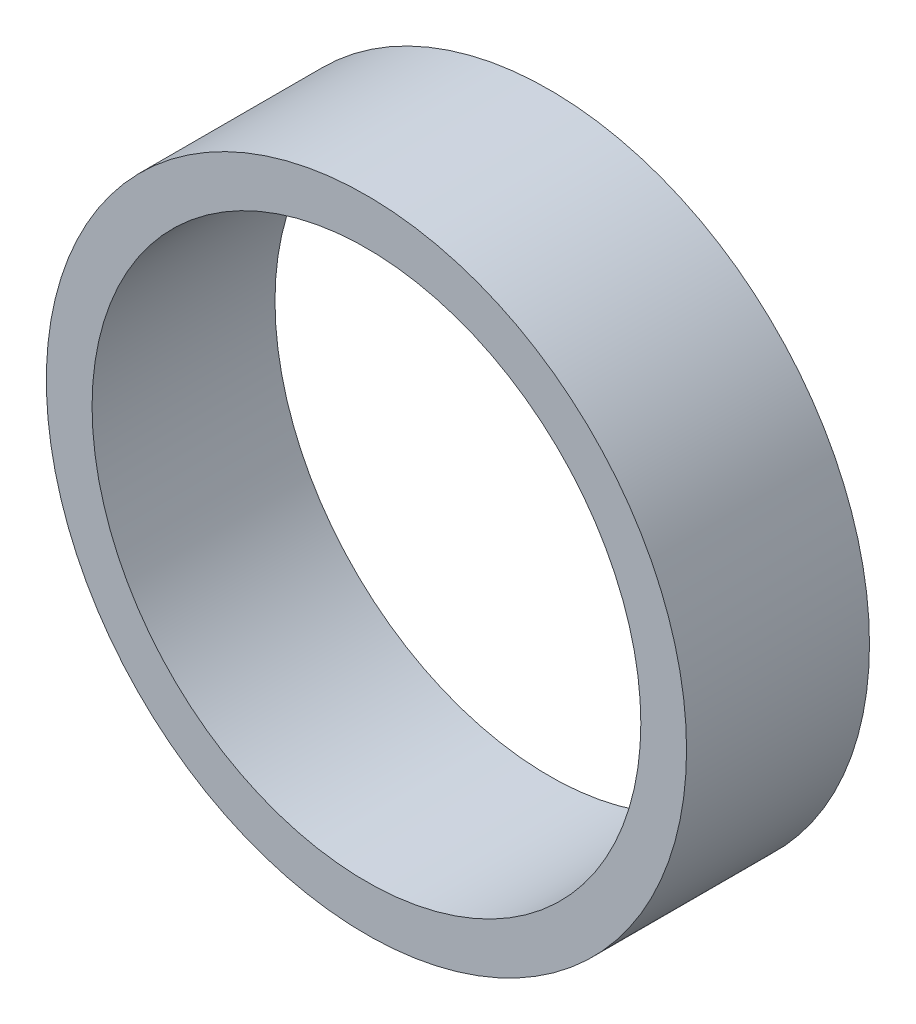
ISO-10303-21;
HEADER;
FILE_DESCRIPTION(('STEP AP214'),'2;1');
FILE_NAME('part.step','',(''),(''),'','','');
FILE_SCHEMA(('AUTOMOTIVE_DESIGN { 1 0 10303 214 1 1 1 1 }'));
ENDSEC;
DATA;
#1=APPLICATION_CONTEXT('core data for automotive mechanical design processes');
#2=APPLICATION_PROTOCOL_DEFINITION('international standard','automotive_design',2000,#1);
#3=PRODUCT_CONTEXT('',#1,'mechanical');
#4=PRODUCT('Part','Part','',(#3));
#5=PRODUCT_RELATED_PRODUCT_CATEGORY('part','',(#4));
#6=PRODUCT_DEFINITION_FORMATION('','',#4);
#7=PRODUCT_DEFINITION_CONTEXT('part definition',#1,'design');
#8=PRODUCT_DEFINITION('design','',#6,#7);
#9=PRODUCT_DEFINITION_SHAPE('','',#8);
#10=(LENGTH_UNIT() NAMED_UNIT(*) SI_UNIT(.MILLI.,.METRE.));
#11=(NAMED_UNIT(*) PLANE_ANGLE_UNIT() SI_UNIT($,.RADIAN.));
#12=(NAMED_UNIT(*) SI_UNIT($,.STERADIAN.) SOLID_ANGLE_UNIT());
#13=UNCERTAINTY_MEASURE_WITH_UNIT(LENGTH_MEASURE(1.E-05),#10,'distance_accuracy_value','');
#14=(GEOMETRIC_REPRESENTATION_CONTEXT(3) GLOBAL_UNCERTAINTY_ASSIGNED_CONTEXT((#13)) GLOBAL_UNIT_ASSIGNED_CONTEXT((#10,
#11,#12)) REPRESENTATION_CONTEXT('',''));
#15=CARTESIAN_POINT('',(0.,0.,0.));
#16=DIRECTION('',(0.,0.,1.));
#17=DIRECTION('',(1.,0.,0.));
#18=AXIS2_PLACEMENT_3D('',#15,#16,#17);
#19=CARTESIAN_POINT('',(0.,0.,2.));
#20=DIRECTION('',(0.,0.,1.));
#21=DIRECTION('',(1.,0.,0.));
#22=AXIS2_PLACEMENT_3D('',#19,#20,#21);
#23=PLANE('',#22);
#24=CARTESIAN_POINT('',(0.,0.,2.));
#25=DIRECTION('',(0.,0.,1.));
#26=DIRECTION('',(1.,0.,0.));
#27=AXIS2_PLACEMENT_3D('',#24,#25,#26);
#28=CIRCLE('',#27,3.5);
#29=CARTESIAN_POINT('',(3.5,0.,2.));
#30=VERTEX_POINT('',#29);
#31=EDGE_CURVE('E10',#30,#30,#28,.T.);
#32=ORIENTED_EDGE('',*,*,#31,.T.);
#33=EDGE_LOOP('',(#32));
#34=FACE_BOUND('',#33,.T.);
#35=CARTESIAN_POINT('',(0.,0.,2.));
#36=DIRECTION('',(0.,0.,1.));
#37=DIRECTION('',(1.,0.,0.));
#38=AXIS2_PLACEMENT_3D('',#35,#36,#37);
#39=CIRCLE('',#38,3.);
#40=CARTESIAN_POINT('',(3.,0.,2.));
#41=VERTEX_POINT('',#40);
#42=EDGE_CURVE('E56',#41,#41,#39,.T.);
#43=ORIENTED_EDGE('',*,*,#42,.F.);
#44=EDGE_LOOP('',(#43));
#45=FACE_BOUND('',#44,.T.);
#46=ADVANCED_FACE('F43',(#34,#45),#23,.T.);
#47=CARTESIAN_POINT('',(0.,0.,0.));
#48=DIRECTION('',(0.,0.,1.));
#49=DIRECTION('',(1.,0.,0.));
#50=AXIS2_PLACEMENT_3D('',#47,#48,#49);
#51=PLANE('',#50);
#52=CARTESIAN_POINT('',(0.,0.,0.));
#53=DIRECTION('',(0.,0.,1.));
#54=DIRECTION('',(1.,0.,0.));
#55=AXIS2_PLACEMENT_3D('',#52,#53,#54);
#56=CIRCLE('',#55,3.5);
#57=CARTESIAN_POINT('',(3.5,0.,0.));
#58=VERTEX_POINT('',#57);
#59=EDGE_CURVE('E47',#58,#58,#56,.T.);
#60=ORIENTED_EDGE('',*,*,#59,.F.);
#61=EDGE_LOOP('',(#60));
#62=FACE_BOUND('',#61,.T.);
#63=CARTESIAN_POINT('',(0.,0.,0.));
#64=DIRECTION('',(0.,0.,1.));
#65=DIRECTION('',(1.,0.,0.));
#66=AXIS2_PLACEMENT_3D('',#63,#64,#65);
#67=CIRCLE('',#66,3.);
#68=CARTESIAN_POINT('',(3.,0.,0.));
#69=VERTEX_POINT('',#68);
#70=EDGE_CURVE('E58',#69,#69,#67,.T.);
#71=ORIENTED_EDGE('',*,*,#70,.T.);
#72=EDGE_LOOP('',(#71));
#73=FACE_BOUND('',#72,.T.);
#74=ADVANCED_FACE('F70',(#62,#73),#51,.F.);
#75=CARTESIAN_POINT('',(0.,0.,2.));
#76=DIRECTION('',(0.,0.,-1.));
#77=DIRECTION('',(-1.,0.,0.));
#78=AXIS2_PLACEMENT_3D('',#75,#76,#77);
#79=CYLINDRICAL_SURFACE('',#78,3.5);
#80=ORIENTED_EDGE('',*,*,#31,.F.);
#81=EDGE_LOOP('',(#80));
#82=FACE_BOUND('',#81,.T.);
#83=ORIENTED_EDGE('',*,*,#59,.T.);
#84=EDGE_LOOP('',(#83));
#85=FACE_BOUND('',#84,.T.);
#86=ADVANCED_FACE('F45',(#82,#85),#79,.T.);
#87=CARTESIAN_POINT('',(0.,0.,2.));
#88=DIRECTION('',(0.,0.,-1.));
#89=DIRECTION('',(-1.,0.,0.));
#90=AXIS2_PLACEMENT_3D('',#87,#88,#89);
#91=CYLINDRICAL_SURFACE('',#90,3.);
#92=ORIENTED_EDGE('',*,*,#42,.T.);
#93=EDGE_LOOP('',(#92));
#94=FACE_BOUND('',#93,.T.);
#95=ORIENTED_EDGE('',*,*,#70,.F.);
#96=EDGE_LOOP('',(#95));
#97=FACE_BOUND('',#96,.T.);
#98=ADVANCED_FACE('F66',(#94,#97),#91,.F.);
#99=CLOSED_SHELL('',(#46,#74,#86,#98));
#100=MANIFOLD_SOLID_BREP('B2',#99);
#101=ADVANCED_BREP_SHAPE_REPRESENTATION('',(#18,#100),#14);
#102=SHAPE_DEFINITION_REPRESENTATION(#9,#101);
ENDSEC;
END-ISO-10303-21;
